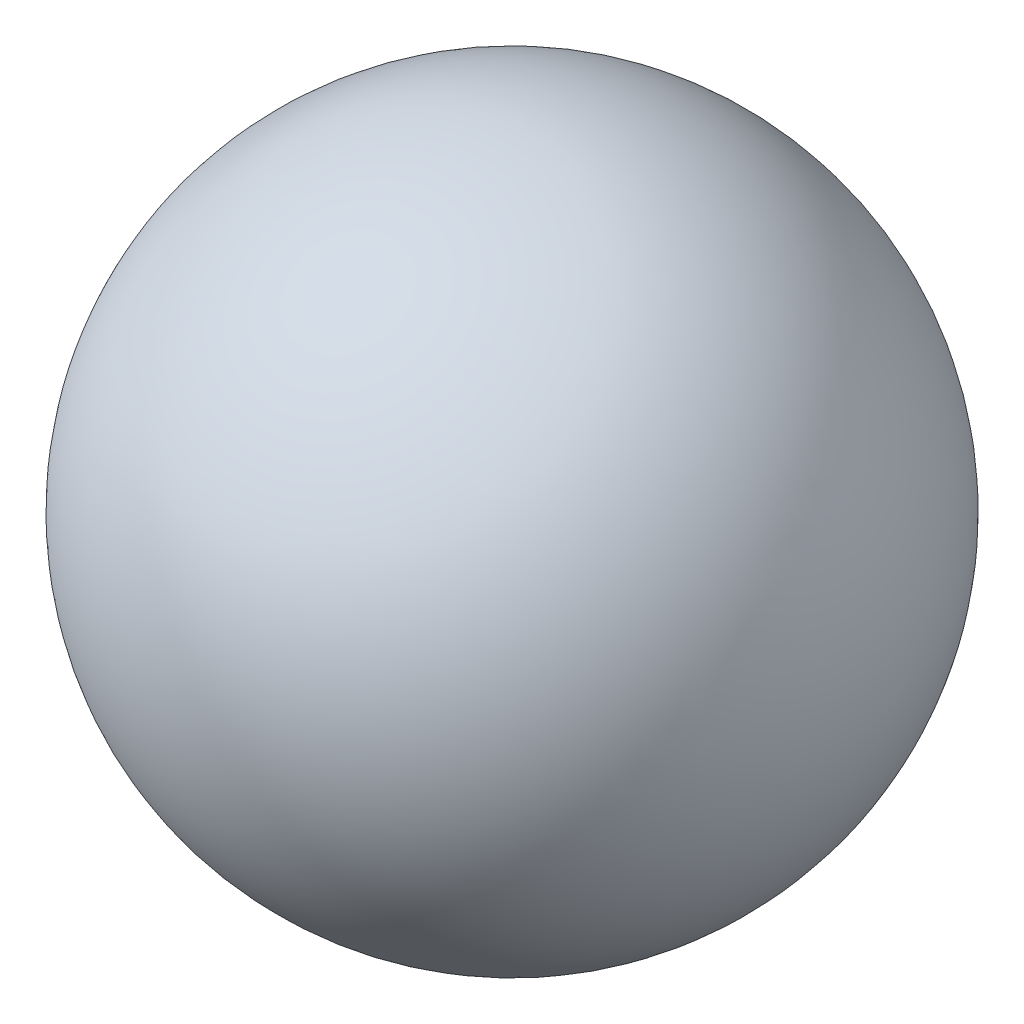
ISO-10303-21;
HEADER;
FILE_DESCRIPTION(('STEP AP214'),'2;1');
FILE_NAME('part.step','',(''),(''),'','','');
FILE_SCHEMA(('AUTOMOTIVE_DESIGN { 1 0 10303 214 1 1 1 1 }'));
ENDSEC;
DATA;
#1=APPLICATION_CONTEXT('core data for automotive mechanical design processes');
#2=APPLICATION_PROTOCOL_DEFINITION('international standard','automotive_design',2000,#1);
#3=PRODUCT_CONTEXT('',#1,'mechanical');
#4=PRODUCT('Part','Part','',(#3));
#5=PRODUCT_RELATED_PRODUCT_CATEGORY('part','',(#4));
#6=PRODUCT_DEFINITION_FORMATION('','',#4);
#7=PRODUCT_DEFINITION_CONTEXT('part definition',#1,'design');
#8=PRODUCT_DEFINITION('design','',#6,#7);
#9=PRODUCT_DEFINITION_SHAPE('','',#8);
#10=(LENGTH_UNIT() NAMED_UNIT(*) SI_UNIT(.MILLI.,.METRE.));
#11=(NAMED_UNIT(*) PLANE_ANGLE_UNIT() SI_UNIT($,.RADIAN.));
#12=(NAMED_UNIT(*) SI_UNIT($,.STERADIAN.) SOLID_ANGLE_UNIT());
#13=UNCERTAINTY_MEASURE_WITH_UNIT(LENGTH_MEASURE(1.E-05),#10,'distance_accuracy_value','');
#14=(GEOMETRIC_REPRESENTATION_CONTEXT(3) GLOBAL_UNCERTAINTY_ASSIGNED_CONTEXT((#13)) GLOBAL_UNIT_ASSIGNED_CONTEXT((#10,
#11,#12)) REPRESENTATION_CONTEXT('',''));
#15=CARTESIAN_POINT('',(0.,0.,0.));
#16=DIRECTION('',(0.,0.,1.));
#17=DIRECTION('',(1.,0.,0.));
#18=AXIS2_PLACEMENT_3D('',#15,#16,#17);
#19=CARTESIAN_POINT('',(3.5,10.,0.));
#20=DIRECTION('',(1.,0.,0.));
#21=DIRECTION('',(0.,-1.,0.));
#22=AXIS2_PLACEMENT_3D('',#19,#20,#21);
#23=SPHERICAL_SURFACE('',#22,2.382);
#24=CARTESIAN_POINT('',(5.882,10.,0.));
#25=VERTEX_POINT('',#24);
#26=VERTEX_LOOP('',#25);
#27=FACE_BOUND('',#26,.T.);
#28=ADVANCED_FACE('F27',(#27),#23,.T.);
#29=CLOSED_SHELL('',(#28));
#30=MANIFOLD_SOLID_BREP('B2',#29);
#31=ADVANCED_BREP_SHAPE_REPRESENTATION('',(#18,#30),#14);
#32=SHAPE_DEFINITION_REPRESENTATION(#9,#31);
ENDSEC;
END-ISO-10303-21;
